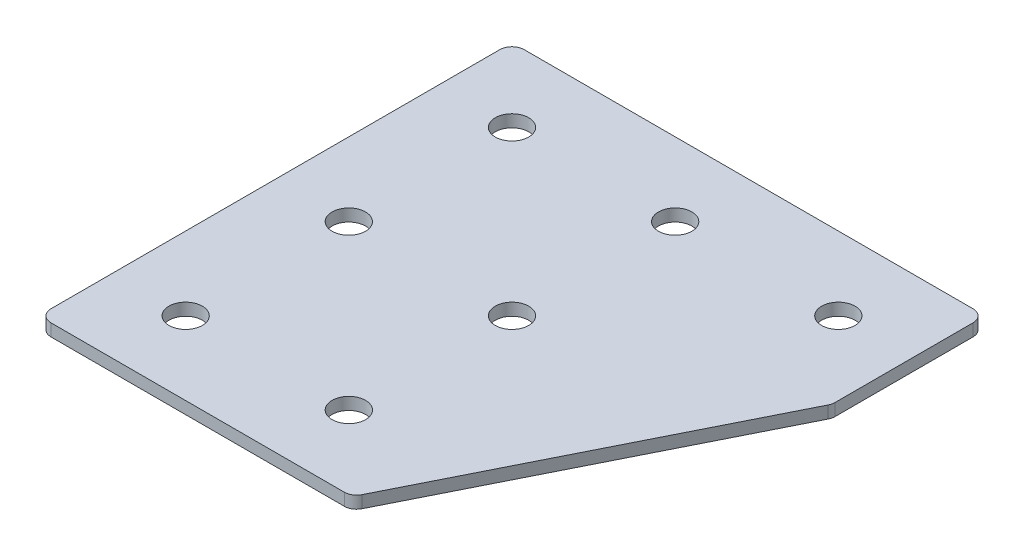
ISO-10303-21;
HEADER;
FILE_DESCRIPTION(('STEP AP214'),'2;1');
FILE_NAME('part.step','',(''),(''),'','','');
FILE_SCHEMA(('AUTOMOTIVE_DESIGN { 1 0 10303 214 1 1 1 1 }'));
ENDSEC;
DATA;
#1=APPLICATION_CONTEXT('core data for automotive mechanical design processes');
#2=APPLICATION_PROTOCOL_DEFINITION('international standard','automotive_design',2000,#1);
#3=PRODUCT_CONTEXT('',#1,'mechanical');
#4=PRODUCT('Part','Part','',(#3));
#5=PRODUCT_RELATED_PRODUCT_CATEGORY('part','',(#4));
#6=PRODUCT_DEFINITION_FORMATION('','',#4);
#7=PRODUCT_DEFINITION_CONTEXT('part definition',#1,'design');
#8=PRODUCT_DEFINITION('design','',#6,#7);
#9=PRODUCT_DEFINITION_SHAPE('','',#8);
#10=(LENGTH_UNIT() NAMED_UNIT(*) SI_UNIT(.MILLI.,.METRE.));
#11=(NAMED_UNIT(*) PLANE_ANGLE_UNIT() SI_UNIT($,.RADIAN.));
#12=(NAMED_UNIT(*) SI_UNIT($,.STERADIAN.) SOLID_ANGLE_UNIT());
#13=UNCERTAINTY_MEASURE_WITH_UNIT(LENGTH_MEASURE(1.E-05),#10,'distance_accuracy_value','');
#14=(GEOMETRIC_REPRESENTATION_CONTEXT(3) GLOBAL_UNCERTAINTY_ASSIGNED_CONTEXT((#13)) GLOBAL_UNIT_ASSIGNED_CONTEXT((#10,
#11,#12)) REPRESENTATION_CONTEXT('',''));
#15=CARTESIAN_POINT('',(0.,0.,0.));
#16=DIRECTION('',(0.,0.,1.));
#17=DIRECTION('',(1.,0.,0.));
#18=AXIS2_PLACEMENT_3D('',#15,#16,#17);
#19=CARTESIAN_POINT('',(-21.2659080191496,1.20798729371791,-41.4416391865666));
#20=DIRECTION('',(0.,-1.,0.));
#21=DIRECTION('',(0.,0.,-1.));
#22=AXIS2_PLACEMENT_3D('',#19,#20,#21);
#23=PLANE('',#22);
#24=CARTESIAN_POINT('',(-1.26590801914959,1.20798729371791,38.5583608134335));
#25=DIRECTION('',(0.,1.,0.));
#26=DIRECTION('',(0.,0.,1.));
#27=AXIS2_PLACEMENT_3D('',#24,#25,#26);
#28=CIRCLE('',#27,4.1);
#29=CARTESIAN_POINT('',(-1.26590801914959,1.20798729371791,42.6583608134335));
#30=VERTEX_POINT('',#29);
#31=EDGE_CURVE('E255',#30,#30,#28,.T.);
#32=ORIENTED_EDGE('',*,*,#31,.T.);
#33=EDGE_LOOP('',(#32));
#34=FACE_BOUND('',#33,.T.);
#35=CARTESIAN_POINT('',(-41.2659080191496,1.20798729371791,38.5583608134335));
#36=DIRECTION('',(0.,1.,0.));
#37=DIRECTION('',(0.,0.,1.));
#38=AXIS2_PLACEMENT_3D('',#35,#36,#37);
#39=CIRCLE('',#38,4.1);
#40=CARTESIAN_POINT('',(-41.2659080191496,1.20798729371791,42.6583608134335));
#41=VERTEX_POINT('',#40);
#42=EDGE_CURVE('E263',#41,#41,#39,.T.);
#43=ORIENTED_EDGE('',*,*,#42,.T.);
#44=EDGE_LOOP('',(#43));
#45=FACE_BOUND('',#44,.T.);
#46=CARTESIAN_POINT('',(-1.26590801914959,1.20798729371791,-1.44163918656655));
#47=DIRECTION('',(0.,1.,0.));
#48=DIRECTION('',(0.,0.,1.));
#49=AXIS2_PLACEMENT_3D('',#46,#47,#48);
#50=CIRCLE('',#49,4.1);
#51=CARTESIAN_POINT('',(-1.26590801914959,1.20798729371791,2.65836081343345));
#52=VERTEX_POINT('',#51);
#53=EDGE_CURVE('E269',#52,#52,#50,.T.);
#54=ORIENTED_EDGE('',*,*,#53,.T.);
#55=EDGE_LOOP('',(#54));
#56=FACE_BOUND('',#55,.T.);
#57=CARTESIAN_POINT('',(-41.2659080191496,1.20798729371791,-1.44163918656654));
#58=DIRECTION('',(0.,1.,0.));
#59=DIRECTION('',(0.,0.,1.));
#60=AXIS2_PLACEMENT_3D('',#57,#58,#59);
#61=CIRCLE('',#60,4.1);
#62=CARTESIAN_POINT('',(-41.2659080191496,1.20798729371791,2.65836081343346));
#63=VERTEX_POINT('',#62);
#64=EDGE_CURVE('E275',#63,#63,#61,.T.);
#65=ORIENTED_EDGE('',*,*,#64,.T.);
#66=EDGE_LOOP('',(#65));
#67=FACE_BOUND('',#66,.T.);
#68=CARTESIAN_POINT('',(38.7340919808504,1.20798729371791,-41.4416391865665));
#69=DIRECTION('',(0.,1.,0.));
#70=DIRECTION('',(0.,0.,1.));
#71=AXIS2_PLACEMENT_3D('',#68,#69,#70);
#72=CIRCLE('',#71,4.09999999999999);
#73=CARTESIAN_POINT('',(38.7340919808504,1.20798729371791,-37.3416391865666));
#74=VERTEX_POINT('',#73);
#75=EDGE_CURVE('E281',#74,#74,#72,.T.);
#76=ORIENTED_EDGE('',*,*,#75,.T.);
#77=EDGE_LOOP('',(#76));
#78=FACE_BOUND('',#77,.T.);
#79=CARTESIAN_POINT('',(-1.26590801914959,1.20798729371791,-41.4416391865665));
#80=DIRECTION('',(0.,1.,0.));
#81=DIRECTION('',(0.,0.,1.));
#82=AXIS2_PLACEMENT_3D('',#79,#80,#81);
#83=CIRCLE('',#82,4.1);
#84=CARTESIAN_POINT('',(-1.26590801914959,1.20798729371791,-37.3416391865666));
#85=VERTEX_POINT('',#84);
#86=EDGE_CURVE('E287',#85,#85,#83,.T.);
#87=ORIENTED_EDGE('',*,*,#86,.T.);
#88=EDGE_LOOP('',(#87));
#89=FACE_BOUND('',#88,.T.);
#90=CARTESIAN_POINT('',(-41.2659080191496,1.20798729371791,-41.4416391865666));
#91=DIRECTION('',(0.,1.,0.));
#92=DIRECTION('',(0.,0.,1.));
#93=AXIS2_PLACEMENT_3D('',#90,#91,#92);
#94=CIRCLE('',#93,4.1);
#95=CARTESIAN_POINT('',(-41.2659080191496,1.20798729371791,-37.3416391865666));
#96=VERTEX_POINT('',#95);
#97=EDGE_CURVE('E175',#96,#96,#94,.T.);
#98=ORIENTED_EDGE('',*,*,#97,.T.);
#99=EDGE_LOOP('',(#98));
#100=FACE_BOUND('',#99,.T.);
#101=DIRECTION('',(1.,0.,0.));
#102=VECTOR('',#101,1.);
#103=CARTESIAN_POINT('',(-59.2659080191497,1.20798729371791,56.5583608134334));
#104=LINE('',#103,#102);
#105=CARTESIAN_POINT('',(-56.2659080191497,1.20798729371791,56.5583608134334));
#106=VERTEX_POINT('',#105);
#107=CARTESIAN_POINT('',(15.643922037101,1.20798729371791,56.5583608134334));
#108=VERTEX_POINT('',#107);
#109=EDGE_CURVE('E121',#106,#108,#104,.T.);
#110=ORIENTED_EDGE('',*,*,#109,.F.);
#111=CARTESIAN_POINT('',(-56.2659080191497,1.20798729371791,53.5583608134334));
#112=DIRECTION('',(0.,-1.,0.));
#113=DIRECTION('',(0.,0.,-1.));
#114=AXIS2_PLACEMENT_3D('',#111,#112,#113);
#115=CIRCLE('',#114,3.);
#116=CARTESIAN_POINT('',(-59.2659080191497,1.20798729371791,53.5583608134334));
#117=VERTEX_POINT('',#116);
#118=EDGE_CURVE('E145',#106,#117,#115,.T.);
#119=ORIENTED_EDGE('',*,*,#118,.T.);
#120=DIRECTION('',(0.,0.,1.));
#121=VECTOR('',#120,1.);
#122=CARTESIAN_POINT('',(-59.2659080191497,1.20798729371791,-59.4416391865666));
#123=LINE('',#122,#121);
#124=CARTESIAN_POINT('',(-59.2659080191497,1.20798729371791,-56.4416391865666));
#125=VERTEX_POINT('',#124);
#126=EDGE_CURVE('E162',#125,#117,#123,.T.);
#127=ORIENTED_EDGE('',*,*,#126,.F.);
#128=CARTESIAN_POINT('',(-56.2659080191497,1.20798729371791,-56.4416391865666));
#129=DIRECTION('',(0.,-1.,0.));
#130=DIRECTION('',(0.,0.,-1.));
#131=AXIS2_PLACEMENT_3D('',#128,#129,#130);
#132=CIRCLE('',#131,3.);
#133=CARTESIAN_POINT('',(-56.2659080191497,1.20798729371791,-59.4416391865666));
#134=VERTEX_POINT('',#133);
#135=EDGE_CURVE('E117',#125,#134,#132,.T.);
#136=ORIENTED_EDGE('',*,*,#135,.T.);
#137=DIRECTION('',(-1.,0.,0.));
#138=VECTOR('',#137,1.);
#139=CARTESIAN_POINT('',(56.7340919808503,1.20798729371791,-59.4416391865666));
#140=LINE('',#139,#138);
#141=CARTESIAN_POINT('',(53.7340919808503,1.20798729371791,-59.4416391865666));
#142=VERTEX_POINT('',#141);
#143=EDGE_CURVE('E160',#142,#134,#140,.T.);
#144=ORIENTED_EDGE('',*,*,#143,.F.);
#145=CARTESIAN_POINT('',(53.7340919808503,1.20798729371791,-56.4416391865666));
#146=DIRECTION('',(0.,-1.,0.));
#147=DIRECTION('',(0.,0.,-1.));
#148=AXIS2_PLACEMENT_3D('',#145,#146,#147);
#149=CIRCLE('',#148,3.);
#150=CARTESIAN_POINT('',(56.7340919808503,1.20798729371791,-56.4416391865666));
#151=VERTEX_POINT('',#150);
#152=EDGE_CURVE('E140',#142,#151,#149,.T.);
#153=ORIENTED_EDGE('',*,*,#152,.T.);
#154=DIRECTION('',(0.,0.,-1.));
#155=VECTOR('',#154,1.);
#156=CARTESIAN_POINT('',(56.7340919808503,1.20798729371791,-21.9137751415662));
#157=LINE('',#156,#155);
#158=CARTESIAN_POINT('',(56.7340919808503,1.20798729371791,-22.6219790740655));
#159=VERTEX_POINT('',#158);
#160=EDGE_CURVE('E163',#159,#151,#157,.T.);
#161=ORIENTED_EDGE('',*,*,#160,.F.);
#162=CARTESIAN_POINT('',(53.7340919808503,1.20798729371791,-22.6219790740655));
#163=DIRECTION('',(0.,-1.,0.));
#164=DIRECTION('',(0.,0.,-1.));
#165=AXIS2_PLACEMENT_3D('',#162,#163,#164);
#166=CIRCLE('',#165,3.);
#167=CARTESIAN_POINT('',(56.41737355385,1.20798729371791,-21.2803382875656));
#168=VERTEX_POINT('',#167);
#169=EDGE_CURVE('E31',#159,#168,#166,.T.);
#170=ORIENTED_EDGE('',*,*,#169,.T.);
#171=DIRECTION('',(0.447213595499956,0.,-0.894427190999917));
#172=VECTOR('',#171,1.);
#173=CARTESIAN_POINT('',(17.4980240033507,1.20798729371791,56.5583608134334));
#174=LINE('',#173,#172);
#175=CARTESIAN_POINT('',(18.3272036101008,1.20798729371791,54.9000015999333));
#176=VERTEX_POINT('',#175);
#177=EDGE_CURVE('E118',#176,#168,#174,.T.);
#178=ORIENTED_EDGE('',*,*,#177,.F.);
#179=CARTESIAN_POINT('',(15.643922037101,1.20798729371791,53.5583608134334));
#180=DIRECTION('',(0.,-1.,0.));
#181=DIRECTION('',(0.,0.,-1.));
#182=AXIS2_PLACEMENT_3D('',#179,#180,#181);
#183=CIRCLE('',#182,3.);
#184=EDGE_CURVE('E143',#176,#108,#183,.T.);
#185=ORIENTED_EDGE('',*,*,#184,.T.);
#186=EDGE_LOOP('',(#110,#119,#127,#136,#144,#153,#161,#170,#178,#185));
#187=FACE_BOUND('',#186,.T.);
#188=ADVANCED_FACE('F16',(#34,#45,#56,#67,#78,#89,#100,#187),#23,.T.);
#189=CARTESIAN_POINT('',(56.7340919808503,1.20798729371791,-21.9137751415662));
#190=DIRECTION('',(1.,0.,0.));
#191=DIRECTION('',(0.,0.,-1.));
#192=AXIS2_PLACEMENT_3D('',#189,#190,#191);
#193=PLANE('',#192);
#194=DIRECTION('',(0.,0.,-1.));
#195=VECTOR('',#194,1.);
#196=CARTESIAN_POINT('',(56.7340919808503,4.20798729371791,-21.9137751415662));
#197=LINE('',#196,#195);
#198=CARTESIAN_POINT('',(56.7340919808503,4.20798729371791,-22.6219790740655));
#199=VERTEX_POINT('',#198);
#200=CARTESIAN_POINT('',(56.7340919808503,4.20798729371791,-56.4416391865666));
#201=VERTEX_POINT('',#200);
#202=EDGE_CURVE('E172',#199,#201,#197,.T.);
#203=ORIENTED_EDGE('',*,*,#202,.F.);
#204=DIRECTION('',(0.,1.,0.));
#205=VECTOR('',#204,1.);
#206=CARTESIAN_POINT('',(56.7340919808503,1.20798729371791,-22.6219790740655));
#207=LINE('',#206,#205);
#208=EDGE_CURVE('E154',#199,#159,#207,.F.);
#209=ORIENTED_EDGE('',*,*,#208,.T.);
#210=ORIENTED_EDGE('',*,*,#160,.T.);
#211=DIRECTION('',(0.,1.,0.));
#212=VECTOR('',#211,1.);
#213=CARTESIAN_POINT('',(56.7340919808503,1.20798729371791,-56.4416391865666));
#214=LINE('',#213,#212);
#215=EDGE_CURVE('E151',#151,#201,#214,.T.);
#216=ORIENTED_EDGE('',*,*,#215,.T.);
#217=EDGE_LOOP('',(#203,#209,#210,#216));
#218=FACE_BOUND('',#217,.T.);
#219=ADVANCED_FACE('F206',(#218),#193,.T.);
#220=CARTESIAN_POINT('',(17.4980240033507,1.20798729371791,56.5583608134334));
#221=DIRECTION('',(0.894427190999917,0.,0.447213595499956));
#222=DIRECTION('',(0.447213595499956,0.,-0.894427190999917));
#223=AXIS2_PLACEMENT_3D('',#220,#221,#222);
#224=PLANE('',#223);
#225=DIRECTION('',(0.447213595499956,0.,-0.894427190999917));
#226=VECTOR('',#225,1.);
#227=CARTESIAN_POINT('',(17.4980240033507,4.20798729371791,56.5583608134334));
#228=LINE('',#227,#226);
#229=CARTESIAN_POINT('',(18.3272036101008,4.20798729371791,54.9000015999333));
#230=VERTEX_POINT('',#229);
#231=CARTESIAN_POINT('',(56.41737355385,4.20798729371791,-21.2803382875656));
#232=VERTEX_POINT('',#231);
#233=EDGE_CURVE('E124',#230,#232,#228,.T.);
#234=ORIENTED_EDGE('',*,*,#233,.F.);
#235=DIRECTION('',(0.,1.,0.));
#236=VECTOR('',#235,1.);
#237=CARTESIAN_POINT('',(18.3272036101008,1.20798729371791,54.9000015999333));
#238=LINE('',#237,#236);
#239=EDGE_CURVE('E38',#230,#176,#238,.F.);
#240=ORIENTED_EDGE('',*,*,#239,.T.);
#241=ORIENTED_EDGE('',*,*,#177,.T.);
#242=DIRECTION('',(0.,1.,0.));
#243=VECTOR('',#242,1.);
#244=CARTESIAN_POINT('',(56.41737355385,1.20798729371791,-21.2803382875656));
#245=LINE('',#244,#243);
#246=EDGE_CURVE('E147',#168,#232,#245,.T.);
#247=ORIENTED_EDGE('',*,*,#246,.T.);
#248=EDGE_LOOP('',(#234,#240,#241,#247));
#249=FACE_BOUND('',#248,.T.);
#250=ADVANCED_FACE('F180',(#249),#224,.T.);
#251=CARTESIAN_POINT('',(-59.2659080191497,1.20798729371791,56.5583608134334));
#252=DIRECTION('',(0.,0.,1.));
#253=DIRECTION('',(1.,0.,0.));
#254=AXIS2_PLACEMENT_3D('',#251,#252,#253);
#255=PLANE('',#254);
#256=DIRECTION('',(1.,0.,0.));
#257=VECTOR('',#256,1.);
#258=CARTESIAN_POINT('',(-59.2659080191497,4.20798729371791,56.5583608134334));
#259=LINE('',#258,#257);
#260=CARTESIAN_POINT('',(-56.2659080191497,4.20798729371791,56.5583608134334));
#261=VERTEX_POINT('',#260);
#262=CARTESIAN_POINT('',(15.643922037101,4.20798729371791,56.5583608134334));
#263=VERTEX_POINT('',#262);
#264=EDGE_CURVE('E114',#261,#263,#259,.T.);
#265=ORIENTED_EDGE('',*,*,#264,.F.);
#266=DIRECTION('',(0.,1.,0.));
#267=VECTOR('',#266,1.);
#268=CARTESIAN_POINT('',(-56.2659080191497,1.20798729371791,56.5583608134334));
#269=LINE('',#268,#267);
#270=EDGE_CURVE('E137',#261,#106,#269,.F.);
#271=ORIENTED_EDGE('',*,*,#270,.T.);
#272=ORIENTED_EDGE('',*,*,#109,.T.);
#273=DIRECTION('',(0.,1.,0.));
#274=VECTOR('',#273,1.);
#275=CARTESIAN_POINT('',(15.643922037101,1.20798729371791,56.5583608134334));
#276=LINE('',#275,#274);
#277=EDGE_CURVE('E134',#108,#263,#276,.T.);
#278=ORIENTED_EDGE('',*,*,#277,.T.);
#279=EDGE_LOOP('',(#265,#271,#272,#278));
#280=FACE_BOUND('',#279,.T.);
#281=ADVANCED_FACE('F189',(#280),#255,.T.);
#282=CARTESIAN_POINT('',(-59.2659080191497,1.20798729371791,-59.4416391865666));
#283=DIRECTION('',(-1.,0.,0.));
#284=DIRECTION('',(0.,0.,1.));
#285=AXIS2_PLACEMENT_3D('',#282,#283,#284);
#286=PLANE('',#285);
#287=ORIENTED_EDGE('',*,*,#126,.T.);
#288=DIRECTION('',(0.,1.,0.));
#289=VECTOR('',#288,1.);
#290=CARTESIAN_POINT('',(-59.2659080191497,1.20798729371791,53.5583608134334));
#291=LINE('',#290,#289);
#292=CARTESIAN_POINT('',(-59.2659080191497,4.20798729371791,53.5583608134334));
#293=VERTEX_POINT('',#292);
#294=EDGE_CURVE('E105',#117,#293,#291,.T.);
#295=ORIENTED_EDGE('',*,*,#294,.T.);
#296=DIRECTION('',(0.,0.,1.));
#297=VECTOR('',#296,1.);
#298=CARTESIAN_POINT('',(-59.2659080191497,4.20798729371791,-59.4416391865666));
#299=LINE('',#298,#297);
#300=CARTESIAN_POINT('',(-59.2659080191497,4.20798729371791,-56.4416391865666));
#301=VERTEX_POINT('',#300);
#302=EDGE_CURVE('E97',#301,#293,#299,.T.);
#303=ORIENTED_EDGE('',*,*,#302,.F.);
#304=DIRECTION('',(0.,1.,0.));
#305=VECTOR('',#304,1.);
#306=CARTESIAN_POINT('',(-59.2659080191497,1.20798729371791,-56.4416391865666));
#307=LINE('',#306,#305);
#308=EDGE_CURVE('E111',#301,#125,#307,.F.);
#309=ORIENTED_EDGE('',*,*,#308,.T.);
#310=EDGE_LOOP('',(#287,#295,#303,#309));
#311=FACE_BOUND('',#310,.T.);
#312=ADVANCED_FACE('F110',(#311),#286,.T.);
#313=CARTESIAN_POINT('',(56.7340919808503,1.20798729371791,-59.4416391865666));
#314=DIRECTION('',(0.,0.,-1.));
#315=DIRECTION('',(-1.,0.,0.));
#316=AXIS2_PLACEMENT_3D('',#313,#314,#315);
#317=PLANE('',#316);
#318=DIRECTION('',(-1.,0.,0.));
#319=VECTOR('',#318,1.);
#320=CARTESIAN_POINT('',(56.7340919808503,4.20798729371791,-59.4416391865666));
#321=LINE('',#320,#319);
#322=CARTESIAN_POINT('',(53.7340919808503,4.20798729371791,-59.4416391865666));
#323=VERTEX_POINT('',#322);
#324=CARTESIAN_POINT('',(-56.2659080191497,4.20798729371791,-59.4416391865666));
#325=VERTEX_POINT('',#324);
#326=EDGE_CURVE('E99',#323,#325,#321,.T.);
#327=ORIENTED_EDGE('',*,*,#326,.F.);
#328=DIRECTION('',(0.,1.,0.));
#329=VECTOR('',#328,1.);
#330=CARTESIAN_POINT('',(53.7340919808503,1.20798729371791,-59.4416391865666));
#331=LINE('',#330,#329);
#332=EDGE_CURVE('E10',#323,#142,#331,.F.);
#333=ORIENTED_EDGE('',*,*,#332,.T.);
#334=ORIENTED_EDGE('',*,*,#143,.T.);
#335=DIRECTION('',(0.,1.,0.));
#336=VECTOR('',#335,1.);
#337=CARTESIAN_POINT('',(-56.2659080191497,1.20798729371791,-59.4416391865666));
#338=LINE('',#337,#336);
#339=EDGE_CURVE('E24',#134,#325,#338,.T.);
#340=ORIENTED_EDGE('',*,*,#339,.T.);
#341=EDGE_LOOP('',(#327,#333,#334,#340));
#342=FACE_BOUND('',#341,.T.);
#343=ADVANCED_FACE('F157',(#342),#317,.T.);
#344=CARTESIAN_POINT('',(-21.2659080191496,4.20798729371791,-41.4416391865666));
#345=DIRECTION('',(0.,-1.,0.));
#346=DIRECTION('',(0.,0.,-1.));
#347=AXIS2_PLACEMENT_3D('',#344,#345,#346);
#348=PLANE('',#347);
#349=CARTESIAN_POINT('',(-1.26590801914959,4.20798729371791,38.5583608134335));
#350=DIRECTION('',(0.,1.,0.));
#351=DIRECTION('',(0.,0.,1.));
#352=AXIS2_PLACEMENT_3D('',#349,#350,#351);
#353=CIRCLE('',#352,4.1);
#354=CARTESIAN_POINT('',(-1.26590801914959,4.20798729371791,42.6583608134335));
#355=VERTEX_POINT('',#354);
#356=EDGE_CURVE('E258',#355,#355,#353,.T.);
#357=ORIENTED_EDGE('',*,*,#356,.F.);
#358=EDGE_LOOP('',(#357));
#359=FACE_BOUND('',#358,.T.);
#360=CARTESIAN_POINT('',(-41.2659080191496,4.20798729371791,38.5583608134335));
#361=DIRECTION('',(0.,1.,0.));
#362=DIRECTION('',(0.,0.,1.));
#363=AXIS2_PLACEMENT_3D('',#360,#361,#362);
#364=CIRCLE('',#363,4.1);
#365=CARTESIAN_POINT('',(-41.2659080191496,4.20798729371791,42.6583608134335));
#366=VERTEX_POINT('',#365);
#367=EDGE_CURVE('E260',#366,#366,#364,.T.);
#368=ORIENTED_EDGE('',*,*,#367,.F.);
#369=EDGE_LOOP('',(#368));
#370=FACE_BOUND('',#369,.T.);
#371=CARTESIAN_POINT('',(-1.26590801914959,4.20798729371791,-1.44163918656655));
#372=DIRECTION('',(0.,1.,0.));
#373=DIRECTION('',(0.,0.,1.));
#374=AXIS2_PLACEMENT_3D('',#371,#372,#373);
#375=CIRCLE('',#374,4.1);
#376=CARTESIAN_POINT('',(-1.26590801914959,4.20798729371791,2.65836081343345));
#377=VERTEX_POINT('',#376);
#378=EDGE_CURVE('E266',#377,#377,#375,.T.);
#379=ORIENTED_EDGE('',*,*,#378,.F.);
#380=EDGE_LOOP('',(#379));
#381=FACE_BOUND('',#380,.T.);
#382=CARTESIAN_POINT('',(-41.2659080191496,4.20798729371791,-1.44163918656654));
#383=DIRECTION('',(0.,1.,0.));
#384=DIRECTION('',(0.,0.,1.));
#385=AXIS2_PLACEMENT_3D('',#382,#383,#384);
#386=CIRCLE('',#385,4.1);
#387=CARTESIAN_POINT('',(-41.2659080191496,4.20798729371791,2.65836081343346));
#388=VERTEX_POINT('',#387);
#389=EDGE_CURVE('E272',#388,#388,#386,.T.);
#390=ORIENTED_EDGE('',*,*,#389,.F.);
#391=EDGE_LOOP('',(#390));
#392=FACE_BOUND('',#391,.T.);
#393=CARTESIAN_POINT('',(38.7340919808504,4.20798729371791,-41.4416391865665));
#394=DIRECTION('',(0.,1.,0.));
#395=DIRECTION('',(0.,0.,1.));
#396=AXIS2_PLACEMENT_3D('',#393,#394,#395);
#397=CIRCLE('',#396,4.09999999999999);
#398=CARTESIAN_POINT('',(38.7340919808504,4.20798729371791,-37.3416391865666));
#399=VERTEX_POINT('',#398);
#400=EDGE_CURVE('E278',#399,#399,#397,.T.);
#401=ORIENTED_EDGE('',*,*,#400,.F.);
#402=EDGE_LOOP('',(#401));
#403=FACE_BOUND('',#402,.T.);
#404=CARTESIAN_POINT('',(-1.26590801914959,4.20798729371791,-41.4416391865665));
#405=DIRECTION('',(0.,1.,0.));
#406=DIRECTION('',(0.,0.,1.));
#407=AXIS2_PLACEMENT_3D('',#404,#405,#406);
#408=CIRCLE('',#407,4.1);
#409=CARTESIAN_POINT('',(-1.26590801914959,4.20798729371791,-37.3416391865666));
#410=VERTEX_POINT('',#409);
#411=EDGE_CURVE('E284',#410,#410,#408,.T.);
#412=ORIENTED_EDGE('',*,*,#411,.F.);
#413=EDGE_LOOP('',(#412));
#414=FACE_BOUND('',#413,.T.);
#415=CARTESIAN_POINT('',(-41.2659080191496,4.20798729371791,-41.4416391865666));
#416=DIRECTION('',(0.,1.,0.));
#417=DIRECTION('',(0.,0.,1.));
#418=AXIS2_PLACEMENT_3D('',#415,#416,#417);
#419=CIRCLE('',#418,4.1);
#420=CARTESIAN_POINT('',(-41.2659080191496,4.20798729371791,-37.3416391865666));
#421=VERTEX_POINT('',#420);
#422=EDGE_CURVE('E290',#421,#421,#419,.T.);
#423=ORIENTED_EDGE('',*,*,#422,.F.);
#424=EDGE_LOOP('',(#423));
#425=FACE_BOUND('',#424,.T.);
#426=ORIENTED_EDGE('',*,*,#302,.T.);
#427=CARTESIAN_POINT('',(-56.2659080191497,4.20798729371791,53.5583608134334));
#428=DIRECTION('',(0.,-1.,0.));
#429=DIRECTION('',(0.,0.,-1.));
#430=AXIS2_PLACEMENT_3D('',#427,#428,#429);
#431=CIRCLE('',#430,3.);
#432=EDGE_CURVE('E132',#293,#261,#431,.F.);
#433=ORIENTED_EDGE('',*,*,#432,.T.);
#434=ORIENTED_EDGE('',*,*,#264,.T.);
#435=CARTESIAN_POINT('',(15.643922037101,4.20798729371791,53.5583608134334));
#436=DIRECTION('',(0.,-1.,0.));
#437=DIRECTION('',(0.,0.,-1.));
#438=AXIS2_PLACEMENT_3D('',#435,#436,#437);
#439=CIRCLE('',#438,3.);
#440=EDGE_CURVE('E130',#263,#230,#439,.F.);
#441=ORIENTED_EDGE('',*,*,#440,.T.);
#442=ORIENTED_EDGE('',*,*,#233,.T.);
#443=CARTESIAN_POINT('',(53.7340919808503,4.20798729371791,-22.6219790740655));
#444=DIRECTION('',(0.,-1.,0.));
#445=DIRECTION('',(0.,0.,-1.));
#446=AXIS2_PLACEMENT_3D('',#443,#444,#445);
#447=CIRCLE('',#446,3.);
#448=EDGE_CURVE('E128',#232,#199,#447,.F.);
#449=ORIENTED_EDGE('',*,*,#448,.T.);
#450=ORIENTED_EDGE('',*,*,#202,.T.);
#451=CARTESIAN_POINT('',(53.7340919808503,4.20798729371791,-56.4416391865666));
#452=DIRECTION('',(0.,-1.,0.));
#453=DIRECTION('',(0.,0.,-1.));
#454=AXIS2_PLACEMENT_3D('',#451,#452,#453);
#455=CIRCLE('',#454,3.);
#456=EDGE_CURVE('E104',#201,#323,#455,.F.);
#457=ORIENTED_EDGE('',*,*,#456,.T.);
#458=ORIENTED_EDGE('',*,*,#326,.T.);
#459=CARTESIAN_POINT('',(-56.2659080191497,4.20798729371791,-56.4416391865666));
#460=DIRECTION('',(0.,-1.,0.));
#461=DIRECTION('',(0.,0.,-1.));
#462=AXIS2_PLACEMENT_3D('',#459,#460,#461);
#463=CIRCLE('',#462,3.);
#464=EDGE_CURVE('E94',#325,#301,#463,.F.);
#465=ORIENTED_EDGE('',*,*,#464,.T.);
#466=EDGE_LOOP('',(#426,#433,#434,#441,#442,#449,#450,#457,#458,#465));
#467=FACE_BOUND('',#466,.T.);
#468=ADVANCED_FACE('F96',(#359,#370,#381,#392,#403,#414,#425,#467),#348,.F.);
#469=CARTESIAN_POINT('',(-56.2659080191497,1.20798729371791,53.5583608134334));
#470=DIRECTION('',(0.,1.,0.));
#471=DIRECTION('',(0.,0.,1.));
#472=AXIS2_PLACEMENT_3D('',#469,#470,#471);
#473=CYLINDRICAL_SURFACE('',#472,3.);
#474=ORIENTED_EDGE('',*,*,#118,.F.);
#475=ORIENTED_EDGE('',*,*,#270,.F.);
#476=ORIENTED_EDGE('',*,*,#432,.F.);
#477=ORIENTED_EDGE('',*,*,#294,.F.);
#478=EDGE_LOOP('',(#474,#475,#476,#477));
#479=FACE_BOUND('',#478,.T.);
#480=ADVANCED_FACE('F192',(#479),#473,.T.);
#481=CARTESIAN_POINT('',(15.643922037101,1.20798729371791,53.5583608134334));
#482=DIRECTION('',(0.,1.,0.));
#483=DIRECTION('',(0.,0.,1.));
#484=AXIS2_PLACEMENT_3D('',#481,#482,#483);
#485=CYLINDRICAL_SURFACE('',#484,3.);
#486=ORIENTED_EDGE('',*,*,#184,.F.);
#487=ORIENTED_EDGE('',*,*,#239,.F.);
#488=ORIENTED_EDGE('',*,*,#440,.F.);
#489=ORIENTED_EDGE('',*,*,#277,.F.);
#490=EDGE_LOOP('',(#486,#487,#488,#489));
#491=FACE_BOUND('',#490,.T.);
#492=ADVANCED_FACE('F184',(#491),#485,.T.);
#493=CARTESIAN_POINT('',(53.7340919808503,1.20798729371791,-22.6219790740655));
#494=DIRECTION('',(0.,1.,0.));
#495=DIRECTION('',(0.,0.,1.));
#496=AXIS2_PLACEMENT_3D('',#493,#494,#495);
#497=CYLINDRICAL_SURFACE('',#496,3.);
#498=ORIENTED_EDGE('',*,*,#169,.F.);
#499=ORIENTED_EDGE('',*,*,#208,.F.);
#500=ORIENTED_EDGE('',*,*,#448,.F.);
#501=ORIENTED_EDGE('',*,*,#246,.F.);
#502=EDGE_LOOP('',(#498,#499,#500,#501));
#503=FACE_BOUND('',#502,.T.);
#504=ADVANCED_FACE('F200',(#503),#497,.T.);
#505=CARTESIAN_POINT('',(53.7340919808503,1.20798729371791,-56.4416391865666));
#506=DIRECTION('',(0.,1.,0.));
#507=DIRECTION('',(0.,0.,1.));
#508=AXIS2_PLACEMENT_3D('',#505,#506,#507);
#509=CYLINDRICAL_SURFACE('',#508,3.);
#510=ORIENTED_EDGE('',*,*,#152,.F.);
#511=ORIENTED_EDGE('',*,*,#332,.F.);
#512=ORIENTED_EDGE('',*,*,#456,.F.);
#513=ORIENTED_EDGE('',*,*,#215,.F.);
#514=EDGE_LOOP('',(#510,#511,#512,#513));
#515=FACE_BOUND('',#514,.T.);
#516=ADVANCED_FACE('F356',(#515),#509,.T.);
#517=CARTESIAN_POINT('',(-56.2659080191497,1.20798729371791,-56.4416391865666));
#518=DIRECTION('',(0.,1.,0.));
#519=DIRECTION('',(0.,0.,1.));
#520=AXIS2_PLACEMENT_3D('',#517,#518,#519);
#521=CYLINDRICAL_SURFACE('',#520,3.);
#522=ORIENTED_EDGE('',*,*,#135,.F.);
#523=ORIENTED_EDGE('',*,*,#308,.F.);
#524=ORIENTED_EDGE('',*,*,#464,.F.);
#525=ORIENTED_EDGE('',*,*,#339,.F.);
#526=EDGE_LOOP('',(#522,#523,#524,#525));
#527=FACE_BOUND('',#526,.T.);
#528=ADVANCED_FACE('F18',(#527),#521,.T.);
#529=CARTESIAN_POINT('',(-41.2659080191496,1.20798729371791,-41.4416391865666));
#530=DIRECTION('',(0.,1.,0.));
#531=DIRECTION('',(0.,0.,1.));
#532=AXIS2_PLACEMENT_3D('',#529,#530,#531);
#533=CYLINDRICAL_SURFACE('',#532,4.1);
#534=ORIENTED_EDGE('',*,*,#97,.F.);
#535=EDGE_LOOP('',(#534));
#536=FACE_BOUND('',#535,.T.);
#537=ORIENTED_EDGE('',*,*,#422,.T.);
#538=EDGE_LOOP('',(#537));
#539=FACE_BOUND('',#538,.T.);
#540=ADVANCED_FACE('F224',(#536,#539),#533,.F.);
#541=CARTESIAN_POINT('',(-1.26590801914959,1.20798729371791,-41.4416391865665));
#542=DIRECTION('',(0.,1.,0.));
#543=DIRECTION('',(0.,0.,1.));
#544=AXIS2_PLACEMENT_3D('',#541,#542,#543);
#545=CYLINDRICAL_SURFACE('',#544,4.1);
#546=ORIENTED_EDGE('',*,*,#86,.F.);
#547=EDGE_LOOP('',(#546));
#548=FACE_BOUND('',#547,.T.);
#549=ORIENTED_EDGE('',*,*,#411,.T.);
#550=EDGE_LOOP('',(#549));
#551=FACE_BOUND('',#550,.T.);
#552=ADVANCED_FACE('F227',(#548,#551),#545,.F.);
#553=CARTESIAN_POINT('',(38.7340919808504,1.20798729371791,-41.4416391865665));
#554=DIRECTION('',(0.,1.,0.));
#555=DIRECTION('',(0.,0.,1.));
#556=AXIS2_PLACEMENT_3D('',#553,#554,#555);
#557=CYLINDRICAL_SURFACE('',#556,4.09999999999999);
#558=ORIENTED_EDGE('',*,*,#75,.F.);
#559=EDGE_LOOP('',(#558));
#560=FACE_BOUND('',#559,.T.);
#561=ORIENTED_EDGE('',*,*,#400,.T.);
#562=EDGE_LOOP('',(#561));
#563=FACE_BOUND('',#562,.T.);
#564=ADVANCED_FACE('F231',(#560,#563),#557,.F.);
#565=CARTESIAN_POINT('',(-41.2659080191496,1.20798729371791,-1.44163918656654));
#566=DIRECTION('',(0.,1.,0.));
#567=DIRECTION('',(0.,0.,1.));
#568=AXIS2_PLACEMENT_3D('',#565,#566,#567);
#569=CYLINDRICAL_SURFACE('',#568,4.1);
#570=ORIENTED_EDGE('',*,*,#64,.F.);
#571=EDGE_LOOP('',(#570));
#572=FACE_BOUND('',#571,.T.);
#573=ORIENTED_EDGE('',*,*,#389,.T.);
#574=EDGE_LOOP('',(#573));
#575=FACE_BOUND('',#574,.T.);
#576=ADVANCED_FACE('F235',(#572,#575),#569,.F.);
#577=CARTESIAN_POINT('',(-1.26590801914959,1.20798729371791,-1.44163918656655));
#578=DIRECTION('',(0.,1.,0.));
#579=DIRECTION('',(0.,0.,1.));
#580=AXIS2_PLACEMENT_3D('',#577,#578,#579);
#581=CYLINDRICAL_SURFACE('',#580,4.1);
#582=ORIENTED_EDGE('',*,*,#53,.F.);
#583=EDGE_LOOP('',(#582));
#584=FACE_BOUND('',#583,.T.);
#585=ORIENTED_EDGE('',*,*,#378,.T.);
#586=EDGE_LOOP('',(#585));
#587=FACE_BOUND('',#586,.T.);
#588=ADVANCED_FACE('F239',(#584,#587),#581,.F.);
#589=CARTESIAN_POINT('',(-41.2659080191496,1.20798729371791,38.5583608134335));
#590=DIRECTION('',(0.,1.,0.));
#591=DIRECTION('',(0.,0.,1.));
#592=AXIS2_PLACEMENT_3D('',#589,#590,#591);
#593=CYLINDRICAL_SURFACE('',#592,4.1);
#594=ORIENTED_EDGE('',*,*,#42,.F.);
#595=EDGE_LOOP('',(#594));
#596=FACE_BOUND('',#595,.T.);
#597=ORIENTED_EDGE('',*,*,#367,.T.);
#598=EDGE_LOOP('',(#597));
#599=FACE_BOUND('',#598,.T.);
#600=ADVANCED_FACE('F243',(#596,#599),#593,.F.);
#601=CARTESIAN_POINT('',(-1.26590801914959,1.20798729371791,38.5583608134335));
#602=DIRECTION('',(0.,1.,0.));
#603=DIRECTION('',(0.,0.,1.));
#604=AXIS2_PLACEMENT_3D('',#601,#602,#603);
#605=CYLINDRICAL_SURFACE('',#604,4.1);
#606=ORIENTED_EDGE('',*,*,#31,.F.);
#607=EDGE_LOOP('',(#606));
#608=FACE_BOUND('',#607,.T.);
#609=ORIENTED_EDGE('',*,*,#356,.T.);
#610=EDGE_LOOP('',(#609));
#611=FACE_BOUND('',#610,.T.);
#612=ADVANCED_FACE('F247',(#608,#611),#605,.F.);
#613=CLOSED_SHELL('',(#188,#219,#250,#281,#312,#343,#468,#480,#492,#504,#516,#528,#540,#552,
#564,#576,#588,#600,#612));
#614=MANIFOLD_SOLID_BREP('B1',#613);
#615=ADVANCED_BREP_SHAPE_REPRESENTATION('',(#18,#614),#14);
#616=SHAPE_DEFINITION_REPRESENTATION(#9,#615);
ENDSEC;
END-ISO-10303-21;
